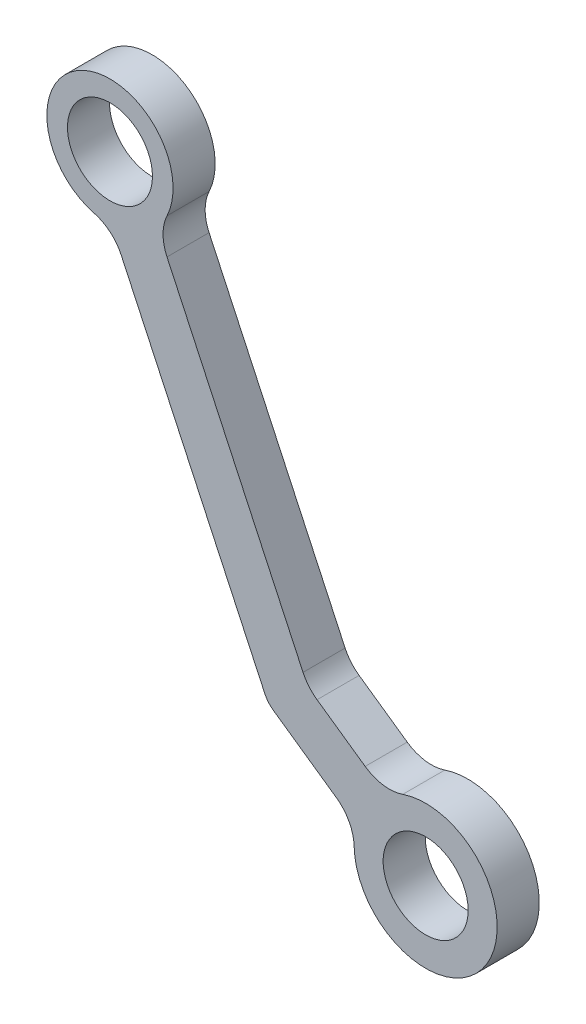
ISO-10303-21;
HEADER;
FILE_DESCRIPTION(('STEP AP214'),'2;1');
FILE_NAME('part.step','',(''),(''),'','','');
FILE_SCHEMA(('AUTOMOTIVE_DESIGN { 1 0 10303 214 1 1 1 1 }'));
ENDSEC;
DATA;
#1=APPLICATION_CONTEXT('core data for automotive mechanical design processes');
#2=APPLICATION_PROTOCOL_DEFINITION('international standard','automotive_design',2000,#1);
#3=PRODUCT_CONTEXT('',#1,'mechanical');
#4=PRODUCT('Part','Part','',(#3));
#5=PRODUCT_RELATED_PRODUCT_CATEGORY('part','',(#4));
#6=PRODUCT_DEFINITION_FORMATION('','',#4);
#7=PRODUCT_DEFINITION_CONTEXT('part definition',#1,'design');
#8=PRODUCT_DEFINITION('design','',#6,#7);
#9=PRODUCT_DEFINITION_SHAPE('','',#8);
#10=(LENGTH_UNIT() NAMED_UNIT(*) SI_UNIT(.MILLI.,.METRE.));
#11=(NAMED_UNIT(*) PLANE_ANGLE_UNIT() SI_UNIT($,.RADIAN.));
#12=(NAMED_UNIT(*) SI_UNIT($,.STERADIAN.) SOLID_ANGLE_UNIT());
#13=UNCERTAINTY_MEASURE_WITH_UNIT(LENGTH_MEASURE(1.E-05),#10,'distance_accuracy_value','');
#14=(GEOMETRIC_REPRESENTATION_CONTEXT(3) GLOBAL_UNCERTAINTY_ASSIGNED_CONTEXT((#13)) GLOBAL_UNIT_ASSIGNED_CONTEXT((#10,
#11,#12)) REPRESENTATION_CONTEXT('',''));
#15=CARTESIAN_POINT('',(0.,0.,0.));
#16=DIRECTION('',(0.,0.,1.));
#17=DIRECTION('',(1.,0.,0.));
#18=AXIS2_PLACEMENT_3D('',#15,#16,#17);
#19=CARTESIAN_POINT('',(26.8362596205347,-57.5505444768271,7.59594193696889));
#20=DIRECTION('',(0.,0.,1.));
#21=DIRECTION('',(1.,0.,0.));
#22=AXIS2_PLACEMENT_3D('',#19,#20,#21);
#23=PLANE('',#22);
#24=CARTESIAN_POINT('',(0.,0.,7.59594193696889));
#25=DIRECTION('',(0.,0.,1.));
#26=DIRECTION('',(1.,0.,0.));
#27=AXIS2_PLACEMENT_3D('',#24,#25,#26);
#28=CIRCLE('',#27,6.4135);
#29=CARTESIAN_POINT('',(6.4135,0.,7.59594193696889));
#30=VERTEX_POINT('',#29);
#31=EDGE_CURVE('E174',#30,#30,#28,.T.);
#32=ORIENTED_EDGE('',*,*,#31,.F.);
#33=EDGE_LOOP('',(#32));
#34=FACE_BOUND('',#33,.T.);
#35=CARTESIAN_POINT('',(26.8362596205347,-57.5505444768271,7.59594193696889));
#36=DIRECTION('',(0.,0.,1.));
#37=DIRECTION('',(1.,0.,0.));
#38=AXIS2_PLACEMENT_3D('',#35,#36,#37);
#39=CIRCLE('',#38,3.80999999999999);
#40=CARTESIAN_POINT('',(23.3832269519251,-59.1607200540592,7.59594193696889));
#41=VERTEX_POINT('',#40);
#42=CARTESIAN_POINT('',(24.6509333980372,-60.6715137655682,7.59594193696889));
#43=VERTEX_POINT('',#42);
#44=EDGE_CURVE('E204',#41,#43,#39,.T.);
#45=ORIENTED_EDGE('',*,*,#44,.T.);
#46=DIRECTION('',(0.819152044288996,-0.57357643635104,0.));
#47=VECTOR('',#46,1.);
#48=CARTESIAN_POINT('',(24.6509333980372,-60.6715137655682,7.59594193696889));
#49=LINE('',#48,#47);
#50=CARTESIAN_POINT('',(34.144629034524,-67.3190710157047,7.59594193696889));
#51=VERTEX_POINT('',#50);
#52=EDGE_CURVE('E116',#43,#51,#49,.T.);
#53=ORIENTED_EDGE('',*,*,#52,.T.);
#54=CARTESIAN_POINT('',(30.5024186636949,-72.5206864969398,7.59594193696889));
#55=DIRECTION('',(0.,0.,-1.));
#56=DIRECTION('',(-1.,0.,0.));
#57=AXIS2_PLACEMENT_3D('',#54,#55,#56);
#58=CIRCLE('',#57,6.34999999999999);
#59=CARTESIAN_POINT('',(36.8506789902802,-72.3720566684968,7.59594193696889));
#60=VERTEX_POINT('',#59);
#61=EDGE_CURVE('E241',#51,#60,#58,.T.);
#62=ORIENTED_EDGE('',*,*,#61,.T.);
#63=CARTESIAN_POINT('',(47.6427215454752,-72.1193859601436,7.59594193696889));
#64=DIRECTION('',(0.,0.,1.));
#65=DIRECTION('',(1.,0.,0.));
#66=AXIS2_PLACEMENT_3D('',#63,#64,#65);
#67=CIRCLE('',#66,10.795);
#68=CARTESIAN_POINT('',(44.1890584040988,-61.8917647359342,7.59594193696889));
#69=VERTEX_POINT('',#68);
#70=EDGE_CURVE('E261',#60,#69,#67,.T.);
#71=ORIENTED_EDGE('',*,*,#70,.T.);
#72=CARTESIAN_POINT('',(42.157491850348,-55.8755169569875,7.59594193696889));
#73=DIRECTION('',(0.,0.,-1.));
#74=DIRECTION('',(1.,0.,0.));
#75=AXIS2_PLACEMENT_3D('',#72,#73,#74);
#76=CIRCLE('',#75,6.34999999999999);
#77=CARTESIAN_POINT('',(38.5152814795189,-61.0771324382226,7.59594193696889));
#78=VERTEX_POINT('',#77);
#79=EDGE_CURVE('E257',#69,#78,#76,.T.);
#80=ORIENTED_EDGE('',*,*,#79,.T.);
#81=DIRECTION('',(-0.819152044288996,0.573576436351041,0.));
#82=VECTOR('',#81,1.);
#83=CARTESIAN_POINT('',(31.2516157110869,-55.9910589121308,7.59594193696889));
#84=LINE('',#83,#82);
#85=CARTESIAN_POINT('',(31.2516157110869,-55.9910589121308,7.59594193696889));
#86=VERTEX_POINT('',#85);
#87=EDGE_CURVE('E260',#78,#86,#84,.T.);
#88=ORIENTED_EDGE('',*,*,#87,.T.);
#89=CARTESIAN_POINT('',(34.893826081916,-50.7894434308956,7.59594193696889));
#90=DIRECTION('',(0.,0.,-1.));
#91=DIRECTION('',(1.,0.,0.));
#92=AXIS2_PLACEMENT_3D('',#89,#90,#91);
#93=CIRCLE('',#92,6.35000000000001);
#94=CARTESIAN_POINT('',(29.1387716342333,-53.4730693929491,7.59594193696889));
#95=VERTEX_POINT('',#94);
#96=EDGE_CURVE('E265',#86,#95,#93,.T.);
#97=ORIENTED_EDGE('',*,*,#96,.T.);
#98=DIRECTION('',(-0.422618261740704,0.906307787036648,0.));
#99=VECTOR('',#98,1.);
#100=CARTESIAN_POINT('',(29.1387716342333,-53.4730693929491,7.59594193696889));
#101=LINE('',#100,#99);
#102=CARTESIAN_POINT('',(8.60810980115821,-9.4449230092788,7.59594193696889));
#103=VERTEX_POINT('',#102);
#104=EDGE_CURVE('E272',#95,#103,#101,.T.);
#105=ORIENTED_EDGE('',*,*,#104,.T.);
#106=CARTESIAN_POINT('',(14.3631642488409,-6.76129704722533,7.59594193696889));
#107=DIRECTION('',(0.,0.,-1.));
#108=DIRECTION('',(-1.,0.,0.));
#109=AXIS2_PLACEMENT_3D('',#106,#107,#108);
#110=CIRCLE('',#109,6.35);
#111=CARTESIAN_POINT('',(8.61789854930455,-4.0567782283352,7.59594193696889));
#112=VERTEX_POINT('',#111);
#113=EDGE_CURVE('E147',#103,#112,#110,.T.);
#114=ORIENTED_EDGE('',*,*,#113,.T.);
#115=CARTESIAN_POINT('',(0.,0.,7.59594193696889));
#116=DIRECTION('',(0.,0.,1.));
#117=DIRECTION('',(1.,0.,0.));
#118=AXIS2_PLACEMENT_3D('',#115,#116,#117);
#119=CIRCLE('',#118,9.525);
#120=CARTESIAN_POINT('',(-2.43180599024625,-9.20934007547785,7.59594193696889));
#121=VERTEX_POINT('',#120);
#122=EDGE_CURVE('E141',#112,#121,#119,.T.);
#123=ORIENTED_EDGE('',*,*,#122,.T.);
#124=CARTESIAN_POINT('',(-4.05300998374375,-15.3489001257964,7.59594193696889));
#125=DIRECTION('',(0.,0.,-1.));
#126=DIRECTION('',(1.,0.,0.));
#127=AXIS2_PLACEMENT_3D('',#124,#125,#126);
#128=CIRCLE('',#127,6.35);
#129=CARTESIAN_POINT('',(1.70204446393897,-12.665274163743,7.59594193696889));
#130=VERTEX_POINT('',#129);
#131=EDGE_CURVE('E145',#121,#130,#128,.T.);
#132=ORIENTED_EDGE('',*,*,#131,.T.);
#133=DIRECTION('',(0.422618261740704,-0.906307787036648,0.));
#134=VECTOR('',#133,1.);
#135=CARTESIAN_POINT('',(1.70204446393897,-12.665274163743,7.59594193696889));
#136=LINE('',#135,#134);
#137=EDGE_CURVE('E61',#130,#41,#136,.T.);
#138=ORIENTED_EDGE('',*,*,#137,.T.);
#139=EDGE_LOOP('',(#45,#53,#62,#71,#80,#88,#97,#105,#114,#123,#132,#138));
#140=FACE_BOUND('',#139,.T.);
#141=CARTESIAN_POINT('',(47.6427215454752,-72.1193859601436,7.59594193696889));
#142=DIRECTION('',(0.,0.,1.));
#143=DIRECTION('',(1.,0.,0.));
#144=AXIS2_PLACEMENT_3D('',#141,#142,#143);
#145=CIRCLE('',#144,6.4135);
#146=CARTESIAN_POINT('',(54.0562215454752,-72.1193859601436,7.59594193696889));
#147=VERTEX_POINT('',#146);
#148=EDGE_CURVE('E316',#147,#147,#145,.T.);
#149=ORIENTED_EDGE('',*,*,#148,.F.);
#150=EDGE_LOOP('',(#149));
#151=FACE_BOUND('',#150,.T.);
#152=ADVANCED_FACE('F43',(#34,#140,#151),#23,.T.);
#153=CARTESIAN_POINT('',(26.8362596205347,-57.5505444768271,1.24594193696889));
#154=DIRECTION('',(0.,0.,1.));
#155=DIRECTION('',(1.,0.,0.));
#156=AXIS2_PLACEMENT_3D('',#153,#154,#155);
#157=PLANE('',#156);
#158=CARTESIAN_POINT('',(26.8362596205347,-57.5505444768271,1.24594193696889));
#159=DIRECTION('',(0.,0.,1.));
#160=DIRECTION('',(1.,0.,0.));
#161=AXIS2_PLACEMENT_3D('',#158,#159,#160);
#162=CIRCLE('',#161,3.80999999999999);
#163=CARTESIAN_POINT('',(23.3832269519251,-59.1607200540592,1.24594193696889));
#164=VERTEX_POINT('',#163);
#165=CARTESIAN_POINT('',(24.6509333980372,-60.6715137655682,1.24594193696889));
#166=VERTEX_POINT('',#165);
#167=EDGE_CURVE('E169',#164,#166,#162,.T.);
#168=ORIENTED_EDGE('',*,*,#167,.F.);
#169=DIRECTION('',(0.422618261740704,-0.906307787036648,0.));
#170=VECTOR('',#169,1.);
#171=CARTESIAN_POINT('',(1.70204446393897,-12.665274163743,1.24594193696889));
#172=LINE('',#171,#170);
#173=CARTESIAN_POINT('',(1.70204446393897,-12.665274163743,1.24594193696889));
#174=VERTEX_POINT('',#173);
#175=EDGE_CURVE('E108',#174,#164,#172,.T.);
#176=ORIENTED_EDGE('',*,*,#175,.F.);
#177=CARTESIAN_POINT('',(-4.05300998374375,-15.3489001257964,1.24594193696889));
#178=DIRECTION('',(0.,0.,-1.));
#179=DIRECTION('',(1.,0.,0.));
#180=AXIS2_PLACEMENT_3D('',#177,#178,#179);
#181=CIRCLE('',#180,6.35);
#182=CARTESIAN_POINT('',(-2.43180599024625,-9.20934007547785,1.24594193696889));
#183=VERTEX_POINT('',#182);
#184=EDGE_CURVE('E102',#183,#174,#181,.T.);
#185=ORIENTED_EDGE('',*,*,#184,.F.);
#186=CARTESIAN_POINT('',(0.,0.,1.24594193696889));
#187=DIRECTION('',(0.,0.,1.));
#188=DIRECTION('',(1.,0.,0.));
#189=AXIS2_PLACEMENT_3D('',#186,#187,#188);
#190=CIRCLE('',#189,9.525);
#191=CARTESIAN_POINT('',(8.61789854930455,-4.0567782283352,1.24594193696889));
#192=VERTEX_POINT('',#191);
#193=EDGE_CURVE('E156',#192,#183,#190,.T.);
#194=ORIENTED_EDGE('',*,*,#193,.F.);
#195=CARTESIAN_POINT('',(14.3631642488409,-6.76129704722533,1.24594193696889));
#196=DIRECTION('',(0.,0.,-1.));
#197=DIRECTION('',(-1.,0.,0.));
#198=AXIS2_PLACEMENT_3D('',#195,#196,#197);
#199=CIRCLE('',#198,6.35);
#200=CARTESIAN_POINT('',(8.60810980115821,-9.4449230092788,1.24594193696889));
#201=VERTEX_POINT('',#200);
#202=EDGE_CURVE('E195',#201,#192,#199,.T.);
#203=ORIENTED_EDGE('',*,*,#202,.F.);
#204=DIRECTION('',(-0.422618261740704,0.906307787036648,0.));
#205=VECTOR('',#204,1.);
#206=CARTESIAN_POINT('',(29.1387716342333,-53.4730693929491,1.24594193696889));
#207=LINE('',#206,#205);
#208=CARTESIAN_POINT('',(29.1387716342333,-53.4730693929491,1.24594193696889));
#209=VERTEX_POINT('',#208);
#210=EDGE_CURVE('E192',#209,#201,#207,.T.);
#211=ORIENTED_EDGE('',*,*,#210,.F.);
#212=CARTESIAN_POINT('',(34.893826081916,-50.7894434308956,1.24594193696889));
#213=DIRECTION('',(0.,0.,-1.));
#214=DIRECTION('',(1.,0.,0.));
#215=AXIS2_PLACEMENT_3D('',#212,#213,#214);
#216=CIRCLE('',#215,6.35000000000001);
#217=CARTESIAN_POINT('',(31.2516157110869,-55.9910589121308,1.24594193696889));
#218=VERTEX_POINT('',#217);
#219=EDGE_CURVE('E189',#218,#209,#216,.T.);
#220=ORIENTED_EDGE('',*,*,#219,.F.);
#221=DIRECTION('',(-0.819152044288996,0.573576436351041,0.));
#222=VECTOR('',#221,1.);
#223=CARTESIAN_POINT('',(31.2516157110869,-55.9910589121308,1.24594193696889));
#224=LINE('',#223,#222);
#225=CARTESIAN_POINT('',(38.5152814795189,-61.0771324382226,1.24594193696889));
#226=VERTEX_POINT('',#225);
#227=EDGE_CURVE('E186',#226,#218,#224,.T.);
#228=ORIENTED_EDGE('',*,*,#227,.F.);
#229=CARTESIAN_POINT('',(42.157491850348,-55.8755169569875,1.24594193696889));
#230=DIRECTION('',(0.,0.,-1.));
#231=DIRECTION('',(1.,0.,0.));
#232=AXIS2_PLACEMENT_3D('',#229,#230,#231);
#233=CIRCLE('',#232,6.34999999999999);
#234=CARTESIAN_POINT('',(44.1890584040988,-61.8917647359342,1.24594193696889));
#235=VERTEX_POINT('',#234);
#236=EDGE_CURVE('E183',#235,#226,#233,.T.);
#237=ORIENTED_EDGE('',*,*,#236,.F.);
#238=CARTESIAN_POINT('',(47.6427215454752,-72.1193859601436,1.24594193696889));
#239=DIRECTION('',(0.,0.,1.));
#240=DIRECTION('',(1.,0.,0.));
#241=AXIS2_PLACEMENT_3D('',#238,#239,#240);
#242=CIRCLE('',#241,10.795);
#243=CARTESIAN_POINT('',(36.8506789902802,-72.3720566684968,1.24594193696889));
#244=VERTEX_POINT('',#243);
#245=EDGE_CURVE('E180',#244,#235,#242,.T.);
#246=ORIENTED_EDGE('',*,*,#245,.F.);
#247=CARTESIAN_POINT('',(30.5024186636949,-72.5206864969398,1.24594193696889));
#248=DIRECTION('',(0.,0.,-1.));
#249=DIRECTION('',(-1.,0.,0.));
#250=AXIS2_PLACEMENT_3D('',#247,#248,#249);
#251=CIRCLE('',#250,6.34999999999999);
#252=CARTESIAN_POINT('',(34.144629034524,-67.3190710157047,1.24594193696889));
#253=VERTEX_POINT('',#252);
#254=EDGE_CURVE('E177',#253,#244,#251,.T.);
#255=ORIENTED_EDGE('',*,*,#254,.F.);
#256=DIRECTION('',(0.819152044288996,-0.57357643635104,0.));
#257=VECTOR('',#256,1.);
#258=CARTESIAN_POINT('',(24.6509333980372,-60.6715137655682,1.24594193696889));
#259=LINE('',#258,#257);
#260=EDGE_CURVE('E173',#166,#253,#259,.T.);
#261=ORIENTED_EDGE('',*,*,#260,.F.);
#262=EDGE_LOOP('',(#168,#176,#185,#194,#203,#211,#220,#228,#237,#246,#255,#261));
#263=FACE_BOUND('',#262,.T.);
#264=CARTESIAN_POINT('',(0.,0.,1.24594193696889));
#265=DIRECTION('',(0.,0.,1.));
#266=DIRECTION('',(1.,0.,0.));
#267=AXIS2_PLACEMENT_3D('',#264,#265,#266);
#268=CIRCLE('',#267,6.4135);
#269=CARTESIAN_POINT('',(6.4135,0.,1.24594193696889));
#270=VERTEX_POINT('',#269);
#271=EDGE_CURVE('E324',#270,#270,#268,.T.);
#272=ORIENTED_EDGE('',*,*,#271,.T.);
#273=EDGE_LOOP('',(#272));
#274=FACE_BOUND('',#273,.T.);
#275=CARTESIAN_POINT('',(47.6427215454752,-72.1193859601436,1.24594193696889));
#276=DIRECTION('',(0.,0.,1.));
#277=DIRECTION('',(1.,0.,0.));
#278=AXIS2_PLACEMENT_3D('',#275,#276,#277);
#279=CIRCLE('',#278,6.4135);
#280=CARTESIAN_POINT('',(54.0562215454752,-72.1193859601436,1.24594193696889));
#281=VERTEX_POINT('',#280);
#282=EDGE_CURVE('E319',#281,#281,#279,.T.);
#283=ORIENTED_EDGE('',*,*,#282,.T.);
#284=EDGE_LOOP('',(#283));
#285=FACE_BOUND('',#284,.T.);
#286=ADVANCED_FACE('F245',(#263,#274,#285),#157,.F.);
#287=CARTESIAN_POINT('',(26.8362596205347,-57.5505444768271,7.59594193696889));
#288=DIRECTION('',(0.,0.,-1.));
#289=DIRECTION('',(-1.,0.,0.));
#290=AXIS2_PLACEMENT_3D('',#287,#288,#289);
#291=CYLINDRICAL_SURFACE('',#290,3.80999999999999);
#292=ORIENTED_EDGE('',*,*,#167,.T.);
#293=DIRECTION('',(0.,0.,-1.));
#294=VECTOR('',#293,1.);
#295=CARTESIAN_POINT('',(24.6509333980372,-60.6715137655682,7.59594193696889));
#296=LINE('',#295,#294);
#297=EDGE_CURVE('E11',#43,#166,#296,.T.);
#298=ORIENTED_EDGE('',*,*,#297,.F.);
#299=ORIENTED_EDGE('',*,*,#44,.F.);
#300=DIRECTION('',(0.,0.,-1.));
#301=VECTOR('',#300,1.);
#302=CARTESIAN_POINT('',(23.3832269519251,-59.1607200540592,7.59594193696889));
#303=LINE('',#302,#301);
#304=EDGE_CURVE('E165',#41,#164,#303,.T.);
#305=ORIENTED_EDGE('',*,*,#304,.T.);
#306=EDGE_LOOP('',(#292,#298,#299,#305));
#307=FACE_BOUND('',#306,.T.);
#308=ADVANCED_FACE('F45',(#307),#291,.T.);
#309=CARTESIAN_POINT('',(24.6509333980372,-60.6715137655682,7.59594193696889));
#310=DIRECTION('',(0.57357643635104,0.819152044288996,0.));
#311=DIRECTION('',(-0.819152044288996,0.57357643635104,0.));
#312=AXIS2_PLACEMENT_3D('',#309,#310,#311);
#313=PLANE('',#312);
#314=ORIENTED_EDGE('',*,*,#260,.T.);
#315=DIRECTION('',(0.,0.,-1.));
#316=VECTOR('',#315,1.);
#317=CARTESIAN_POINT('',(34.144629034524,-67.3190710157047,7.59594193696889));
#318=LINE('',#317,#316);
#319=EDGE_CURVE('E53',#51,#253,#318,.T.);
#320=ORIENTED_EDGE('',*,*,#319,.F.);
#321=ORIENTED_EDGE('',*,*,#52,.F.);
#322=ORIENTED_EDGE('',*,*,#297,.T.);
#323=EDGE_LOOP('',(#314,#320,#321,#322));
#324=FACE_BOUND('',#323,.T.);
#325=ADVANCED_FACE('F432',(#324),#313,.F.);
#326=CARTESIAN_POINT('',(30.5024186636949,-72.5206864969398,7.59594193696889));
#327=DIRECTION('',(0.,0.,-1.));
#328=DIRECTION('',(-1.,0.,0.));
#329=AXIS2_PLACEMENT_3D('',#326,#327,#328);
#330=CYLINDRICAL_SURFACE('',#329,6.34999999999999);
#331=ORIENTED_EDGE('',*,*,#254,.T.);
#332=DIRECTION('',(0.,0.,-1.));
#333=VECTOR('',#332,1.);
#334=CARTESIAN_POINT('',(36.8506789902802,-72.3720566684968,7.59594193696889));
#335=LINE('',#334,#333);
#336=EDGE_CURVE('E231',#60,#244,#335,.T.);
#337=ORIENTED_EDGE('',*,*,#336,.F.);
#338=ORIENTED_EDGE('',*,*,#61,.F.);
#339=ORIENTED_EDGE('',*,*,#319,.T.);
#340=EDGE_LOOP('',(#331,#337,#338,#339));
#341=FACE_BOUND('',#340,.T.);
#342=ADVANCED_FACE('F239',(#341),#330,.F.);
#343=CARTESIAN_POINT('',(47.6427215454752,-72.1193859601436,7.59594193696889));
#344=DIRECTION('',(0.,0.,-1.));
#345=DIRECTION('',(-1.,0.,0.));
#346=AXIS2_PLACEMENT_3D('',#343,#344,#345);
#347=CYLINDRICAL_SURFACE('',#346,10.795);
#348=ORIENTED_EDGE('',*,*,#245,.T.);
#349=DIRECTION('',(0.,0.,-1.));
#350=VECTOR('',#349,1.);
#351=CARTESIAN_POINT('',(44.1890584040988,-61.8917647359342,7.59594193696889));
#352=LINE('',#351,#350);
#353=EDGE_CURVE('E227',#69,#235,#352,.T.);
#354=ORIENTED_EDGE('',*,*,#353,.F.);
#355=ORIENTED_EDGE('',*,*,#70,.F.);
#356=ORIENTED_EDGE('',*,*,#336,.T.);
#357=EDGE_LOOP('',(#348,#354,#355,#356));
#358=FACE_BOUND('',#357,.T.);
#359=ADVANCED_FACE('F251',(#358),#347,.T.);
#360=CARTESIAN_POINT('',(42.157491850348,-55.8755169569875,7.59594193696889));
#361=DIRECTION('',(0.,0.,-1.));
#362=DIRECTION('',(-1.,0.,0.));
#363=AXIS2_PLACEMENT_3D('',#360,#361,#362);
#364=CYLINDRICAL_SURFACE('',#363,6.34999999999999);
#365=ORIENTED_EDGE('',*,*,#236,.T.);
#366=DIRECTION('',(0.,0.,-1.));
#367=VECTOR('',#366,1.);
#368=CARTESIAN_POINT('',(38.5152814795189,-61.0771324382226,7.59594193696889));
#369=LINE('',#368,#367);
#370=EDGE_CURVE('E223',#78,#226,#369,.T.);
#371=ORIENTED_EDGE('',*,*,#370,.F.);
#372=ORIENTED_EDGE('',*,*,#79,.F.);
#373=ORIENTED_EDGE('',*,*,#353,.T.);
#374=EDGE_LOOP('',(#365,#371,#372,#373));
#375=FACE_BOUND('',#374,.T.);
#376=ADVANCED_FACE('F255',(#375),#364,.F.);
#377=CARTESIAN_POINT('',(31.2516157110869,-55.9910589121308,7.59594193696889));
#378=DIRECTION('',(-0.573576436351041,-0.819152044288996,0.));
#379=DIRECTION('',(0.819152044288996,-0.573576436351041,0.));
#380=AXIS2_PLACEMENT_3D('',#377,#378,#379);
#381=PLANE('',#380);
#382=ORIENTED_EDGE('',*,*,#227,.T.);
#383=DIRECTION('',(0.,0.,-1.));
#384=VECTOR('',#383,1.);
#385=CARTESIAN_POINT('',(31.2516157110869,-55.9910589121308,7.59594193696889));
#386=LINE('',#385,#384);
#387=EDGE_CURVE('E219',#86,#218,#386,.T.);
#388=ORIENTED_EDGE('',*,*,#387,.F.);
#389=ORIENTED_EDGE('',*,*,#87,.F.);
#390=ORIENTED_EDGE('',*,*,#370,.T.);
#391=EDGE_LOOP('',(#382,#388,#389,#390));
#392=FACE_BOUND('',#391,.T.);
#393=ADVANCED_FACE('F393',(#392),#381,.F.);
#394=CARTESIAN_POINT('',(34.893826081916,-50.7894434308956,7.59594193696889));
#395=DIRECTION('',(0.,0.,-1.));
#396=DIRECTION('',(-1.,0.,0.));
#397=AXIS2_PLACEMENT_3D('',#394,#395,#396);
#398=CYLINDRICAL_SURFACE('',#397,6.35000000000001);
#399=ORIENTED_EDGE('',*,*,#219,.T.);
#400=DIRECTION('',(0.,0.,-1.));
#401=VECTOR('',#400,1.);
#402=CARTESIAN_POINT('',(29.1387716342333,-53.4730693929491,7.59594193696889));
#403=LINE('',#402,#401);
#404=EDGE_CURVE('E215',#95,#209,#403,.T.);
#405=ORIENTED_EDGE('',*,*,#404,.F.);
#406=ORIENTED_EDGE('',*,*,#96,.F.);
#407=ORIENTED_EDGE('',*,*,#387,.T.);
#408=EDGE_LOOP('',(#399,#405,#406,#407));
#409=FACE_BOUND('',#408,.T.);
#410=ADVANCED_FACE('F383',(#409),#398,.F.);
#411=CARTESIAN_POINT('',(29.1387716342333,-53.4730693929491,7.59594193696889));
#412=DIRECTION('',(-0.906307787036648,-0.422618261740704,0.));
#413=DIRECTION('',(0.422618261740704,-0.906307787036648,0.));
#414=AXIS2_PLACEMENT_3D('',#411,#412,#413);
#415=PLANE('',#414);
#416=ORIENTED_EDGE('',*,*,#210,.T.);
#417=DIRECTION('',(0.,0.,-1.));
#418=VECTOR('',#417,1.);
#419=CARTESIAN_POINT('',(8.60810980115821,-9.4449230092788,7.59594193696889));
#420=LINE('',#419,#418);
#421=EDGE_CURVE('E211',#103,#201,#420,.T.);
#422=ORIENTED_EDGE('',*,*,#421,.F.);
#423=ORIENTED_EDGE('',*,*,#104,.F.);
#424=ORIENTED_EDGE('',*,*,#404,.T.);
#425=EDGE_LOOP('',(#416,#422,#423,#424));
#426=FACE_BOUND('',#425,.T.);
#427=ADVANCED_FACE('F280',(#426),#415,.F.);
#428=CARTESIAN_POINT('',(14.3631642488409,-6.76129704722533,7.59594193696889));
#429=DIRECTION('',(0.,0.,-1.));
#430=DIRECTION('',(-1.,0.,0.));
#431=AXIS2_PLACEMENT_3D('',#428,#429,#430);
#432=CYLINDRICAL_SURFACE('',#431,6.35);
#433=ORIENTED_EDGE('',*,*,#202,.T.);
#434=DIRECTION('',(0.,0.,-1.));
#435=VECTOR('',#434,1.);
#436=CARTESIAN_POINT('',(8.61789854930455,-4.0567782283352,7.59594193696889));
#437=LINE('',#436,#435);
#438=EDGE_CURVE('E158',#112,#192,#437,.T.);
#439=ORIENTED_EDGE('',*,*,#438,.F.);
#440=ORIENTED_EDGE('',*,*,#113,.F.);
#441=ORIENTED_EDGE('',*,*,#421,.T.);
#442=EDGE_LOOP('',(#433,#439,#440,#441));
#443=FACE_BOUND('',#442,.T.);
#444=ADVANCED_FACE('F284',(#443),#432,.F.);
#445=CARTESIAN_POINT('',(0.,0.,7.59594193696889));
#446=DIRECTION('',(0.,0.,-1.));
#447=DIRECTION('',(-1.,0.,0.));
#448=AXIS2_PLACEMENT_3D('',#445,#446,#447);
#449=CYLINDRICAL_SURFACE('',#448,9.525);
#450=ORIENTED_EDGE('',*,*,#193,.T.);
#451=DIRECTION('',(0.,0.,-1.));
#452=VECTOR('',#451,1.);
#453=CARTESIAN_POINT('',(-2.43180599024625,-9.20934007547785,7.59594193696889));
#454=LINE('',#453,#452);
#455=EDGE_CURVE('E153',#121,#183,#454,.T.);
#456=ORIENTED_EDGE('',*,*,#455,.F.);
#457=ORIENTED_EDGE('',*,*,#122,.F.);
#458=ORIENTED_EDGE('',*,*,#438,.T.);
#459=EDGE_LOOP('',(#450,#456,#457,#458));
#460=FACE_BOUND('',#459,.T.);
#461=ADVANCED_FACE('F154',(#460),#449,.T.);
#462=CARTESIAN_POINT('',(-4.05300998374375,-15.3489001257964,7.59594193696889));
#463=DIRECTION('',(0.,0.,-1.));
#464=DIRECTION('',(-1.,0.,0.));
#465=AXIS2_PLACEMENT_3D('',#462,#463,#464);
#466=CYLINDRICAL_SURFACE('',#465,6.35);
#467=ORIENTED_EDGE('',*,*,#184,.T.);
#468=DIRECTION('',(0.,0.,-1.));
#469=VECTOR('',#468,1.);
#470=CARTESIAN_POINT('',(1.70204446393897,-12.665274163743,7.59594193696889));
#471=LINE('',#470,#469);
#472=EDGE_CURVE('E159',#130,#174,#471,.T.);
#473=ORIENTED_EDGE('',*,*,#472,.F.);
#474=ORIENTED_EDGE('',*,*,#131,.F.);
#475=ORIENTED_EDGE('',*,*,#455,.T.);
#476=EDGE_LOOP('',(#467,#473,#474,#475));
#477=FACE_BOUND('',#476,.T.);
#478=ADVANCED_FACE('F161',(#477),#466,.F.);
#479=CARTESIAN_POINT('',(1.70204446393897,-12.665274163743,7.59594193696889));
#480=DIRECTION('',(0.906307787036648,0.422618261740704,0.));
#481=DIRECTION('',(-0.422618261740704,0.906307787036648,0.));
#482=AXIS2_PLACEMENT_3D('',#479,#480,#481);
#483=PLANE('',#482);
#484=ORIENTED_EDGE('',*,*,#175,.T.);
#485=ORIENTED_EDGE('',*,*,#304,.F.);
#486=ORIENTED_EDGE('',*,*,#137,.F.);
#487=ORIENTED_EDGE('',*,*,#472,.T.);
#488=EDGE_LOOP('',(#484,#485,#486,#487));
#489=FACE_BOUND('',#488,.T.);
#490=ADVANCED_FACE('F288',(#489),#483,.F.);
#491=CARTESIAN_POINT('',(0.,0.,7.59594193696889));
#492=DIRECTION('',(0.,0.,-1.));
#493=DIRECTION('',(-1.,0.,0.));
#494=AXIS2_PLACEMENT_3D('',#491,#492,#493);
#495=CYLINDRICAL_SURFACE('',#494,6.4135);
#496=ORIENTED_EDGE('',*,*,#31,.T.);
#497=EDGE_LOOP('',(#496));
#498=FACE_BOUND('',#497,.T.);
#499=ORIENTED_EDGE('',*,*,#271,.F.);
#500=EDGE_LOOP('',(#499));
#501=FACE_BOUND('',#500,.T.);
#502=ADVANCED_FACE('F290',(#498,#501),#495,.F.);
#503=CARTESIAN_POINT('',(47.6427215454752,-72.1193859601436,7.59594193696889));
#504=DIRECTION('',(0.,0.,-1.));
#505=DIRECTION('',(-1.,0.,0.));
#506=AXIS2_PLACEMENT_3D('',#503,#504,#505);
#507=CYLINDRICAL_SURFACE('',#506,6.4135);
#508=ORIENTED_EDGE('',*,*,#148,.T.);
#509=EDGE_LOOP('',(#508));
#510=FACE_BOUND('',#509,.T.);
#511=ORIENTED_EDGE('',*,*,#282,.F.);
#512=EDGE_LOOP('',(#511));
#513=FACE_BOUND('',#512,.T.);
#514=ADVANCED_FACE('F296',(#510,#513),#507,.F.);
#515=CLOSED_SHELL('',(#152,#286,#308,#325,#342,#359,#376,#393,#410,#427,#444,#461,#478,#490,
#502,#514));
#516=MANIFOLD_SOLID_BREP('B2',#515);
#517=ADVANCED_BREP_SHAPE_REPRESENTATION('',(#18,#516),#14);
#518=SHAPE_DEFINITION_REPRESENTATION(#9,#517);
ENDSEC;
END-ISO-10303-21;
